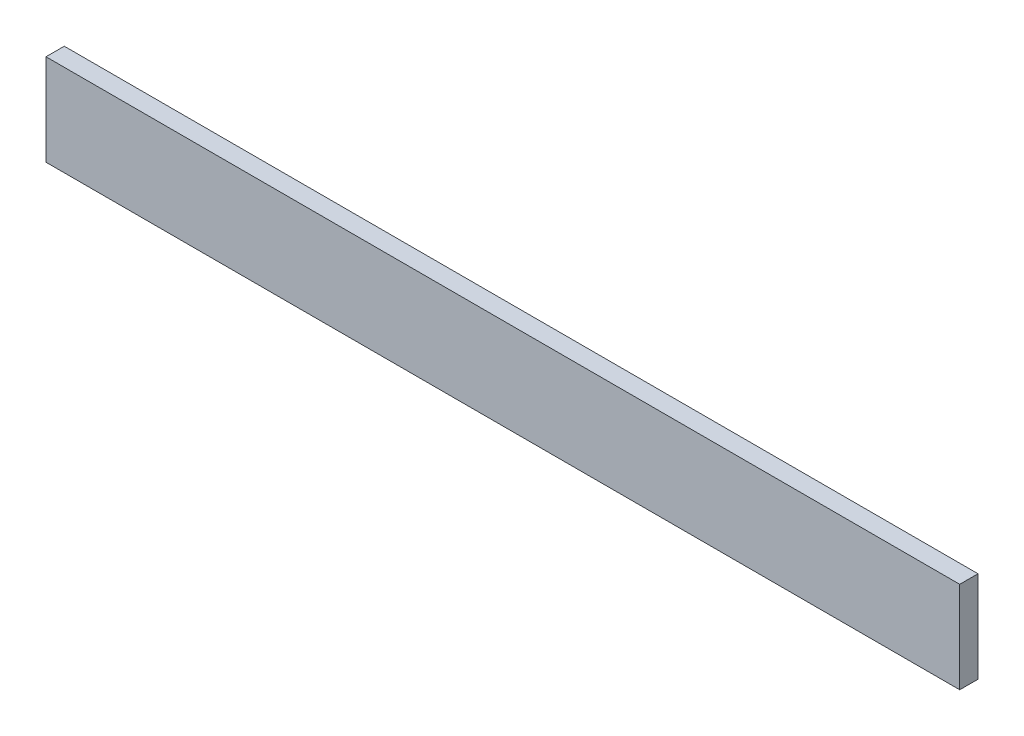
ISO-10303-21;
HEADER;
FILE_DESCRIPTION(('STEP AP214'),'2;1');
FILE_NAME('part.step','',(''),(''),'','','');
FILE_SCHEMA(('AUTOMOTIVE_DESIGN { 1 0 10303 214 1 1 1 1 }'));
ENDSEC;
DATA;
#1=APPLICATION_CONTEXT('core data for automotive mechanical design processes');
#2=APPLICATION_PROTOCOL_DEFINITION('international standard','automotive_design',2000,#1);
#3=PRODUCT_CONTEXT('',#1,'mechanical');
#4=PRODUCT('Part','Part','',(#3));
#5=PRODUCT_RELATED_PRODUCT_CATEGORY('part','',(#4));
#6=PRODUCT_DEFINITION_FORMATION('','',#4);
#7=PRODUCT_DEFINITION_CONTEXT('part definition',#1,'design');
#8=PRODUCT_DEFINITION('design','',#6,#7);
#9=PRODUCT_DEFINITION_SHAPE('','',#8);
#10=(LENGTH_UNIT() NAMED_UNIT(*) SI_UNIT(.MILLI.,.METRE.));
#11=(NAMED_UNIT(*) PLANE_ANGLE_UNIT() SI_UNIT($,.RADIAN.));
#12=(NAMED_UNIT(*) SI_UNIT($,.STERADIAN.) SOLID_ANGLE_UNIT());
#13=UNCERTAINTY_MEASURE_WITH_UNIT(LENGTH_MEASURE(1.E-05),#10,'distance_accuracy_value','');
#14=(GEOMETRIC_REPRESENTATION_CONTEXT(3) GLOBAL_UNCERTAINTY_ASSIGNED_CONTEXT((#13)) GLOBAL_UNIT_ASSIGNED_CONTEXT((#10,
#11,#12)) REPRESENTATION_CONTEXT('',''));
#15=CARTESIAN_POINT('',(0.,0.,0.));
#16=DIRECTION('',(0.,0.,1.));
#17=DIRECTION('',(1.,0.,0.));
#18=AXIS2_PLACEMENT_3D('',#15,#16,#17);
#19=CARTESIAN_POINT('',(317.5,-31.75,12.7));
#20=DIRECTION('',(-1.,0.,0.));
#21=DIRECTION('',(0.,0.,1.));
#22=AXIS2_PLACEMENT_3D('',#19,#20,#21);
#23=PLANE('',#22);
#24=DIRECTION('',(0.,1.,0.));
#25=VECTOR('',#24,1.);
#26=CARTESIAN_POINT('',(317.5,-31.75,0.));
#27=LINE('',#26,#25);
#28=CARTESIAN_POINT('',(317.5,-31.75,0.));
#29=VERTEX_POINT('',#28);
#30=CARTESIAN_POINT('',(317.5,31.75,0.));
#31=VERTEX_POINT('',#30);
#32=EDGE_CURVE('E96',#29,#31,#27,.T.);
#33=ORIENTED_EDGE('',*,*,#32,.T.);
#34=DIRECTION('',(0.,0.,-1.));
#35=VECTOR('',#34,1.);
#36=CARTESIAN_POINT('',(317.5,31.75,12.7));
#37=LINE('',#36,#35);
#38=CARTESIAN_POINT('',(317.5,31.75,12.7));
#39=VERTEX_POINT('',#38);
#40=EDGE_CURVE('E11',#39,#31,#37,.T.);
#41=ORIENTED_EDGE('',*,*,#40,.F.);
#42=DIRECTION('',(0.,1.,0.));
#43=VECTOR('',#42,1.);
#44=CARTESIAN_POINT('',(317.5,-31.75,12.7));
#45=LINE('',#44,#43);
#46=CARTESIAN_POINT('',(317.5,-31.75,12.7));
#47=VERTEX_POINT('',#46);
#48=EDGE_CURVE('E84',#47,#39,#45,.T.);
#49=ORIENTED_EDGE('',*,*,#48,.F.);
#50=DIRECTION('',(0.,0.,-1.));
#51=VECTOR('',#50,1.);
#52=CARTESIAN_POINT('',(317.5,-31.75,12.7));
#53=LINE('',#52,#51);
#54=EDGE_CURVE('E92',#47,#29,#53,.T.);
#55=ORIENTED_EDGE('',*,*,#54,.T.);
#56=EDGE_LOOP('',(#33,#41,#49,#55));
#57=FACE_BOUND('',#56,.T.);
#58=ADVANCED_FACE('F33',(#57),#23,.F.);
#59=CARTESIAN_POINT('',(-317.5,31.75,12.7));
#60=DIRECTION('',(0.,-1.,0.));
#61=DIRECTION('',(0.,0.,-1.));
#62=AXIS2_PLACEMENT_3D('',#59,#60,#61);
#63=PLANE('',#62);
#64=DIRECTION('',(-1.,0.,0.));
#65=VECTOR('',#64,1.);
#66=CARTESIAN_POINT('',(-317.5,31.75,0.));
#67=LINE('',#66,#65);
#68=CARTESIAN_POINT('',(-317.5,31.75,0.));
#69=VERTEX_POINT('',#68);
#70=EDGE_CURVE('E88',#31,#69,#67,.T.);
#71=ORIENTED_EDGE('',*,*,#70,.T.);
#72=DIRECTION('',(0.,0.,-1.));
#73=VECTOR('',#72,1.);
#74=CARTESIAN_POINT('',(-317.5,31.75,12.7));
#75=LINE('',#74,#73);
#76=CARTESIAN_POINT('',(-317.5,31.75,12.7));
#77=VERTEX_POINT('',#76);
#78=EDGE_CURVE('E41',#77,#69,#75,.T.);
#79=ORIENTED_EDGE('',*,*,#78,.F.);
#80=DIRECTION('',(-1.,0.,0.));
#81=VECTOR('',#80,1.);
#82=CARTESIAN_POINT('',(-317.5,31.75,12.7));
#83=LINE('',#82,#81);
#84=EDGE_CURVE('E79',#39,#77,#83,.T.);
#85=ORIENTED_EDGE('',*,*,#84,.F.);
#86=ORIENTED_EDGE('',*,*,#40,.T.);
#87=EDGE_LOOP('',(#71,#79,#85,#86));
#88=FACE_BOUND('',#87,.T.);
#89=ADVANCED_FACE('F87',(#88),#63,.F.);
#90=CARTESIAN_POINT('',(-317.5,-31.75,12.7));
#91=DIRECTION('',(1.,0.,0.));
#92=DIRECTION('',(0.,0.,-1.));
#93=AXIS2_PLACEMENT_3D('',#90,#91,#92);
#94=PLANE('',#93);
#95=DIRECTION('',(0.,-1.,0.));
#96=VECTOR('',#95,1.);
#97=CARTESIAN_POINT('',(-317.5,-31.75,0.));
#98=LINE('',#97,#96);
#99=CARTESIAN_POINT('',(-317.5,-31.75,0.));
#100=VERTEX_POINT('',#99);
#101=EDGE_CURVE('E66',#69,#100,#98,.T.);
#102=ORIENTED_EDGE('',*,*,#101,.T.);
#103=DIRECTION('',(0.,0.,-1.));
#104=VECTOR('',#103,1.);
#105=CARTESIAN_POINT('',(-317.5,-31.75,12.7));
#106=LINE('',#105,#104);
#107=CARTESIAN_POINT('',(-317.5,-31.75,12.7));
#108=VERTEX_POINT('',#107);
#109=EDGE_CURVE('E89',#108,#100,#106,.T.);
#110=ORIENTED_EDGE('',*,*,#109,.F.);
#111=DIRECTION('',(0.,-1.,0.));
#112=VECTOR('',#111,1.);
#113=CARTESIAN_POINT('',(-317.5,-31.75,12.7));
#114=LINE('',#113,#112);
#115=EDGE_CURVE('E82',#77,#108,#114,.T.);
#116=ORIENTED_EDGE('',*,*,#115,.F.);
#117=ORIENTED_EDGE('',*,*,#78,.T.);
#118=EDGE_LOOP('',(#102,#110,#116,#117));
#119=FACE_BOUND('',#118,.T.);
#120=ADVANCED_FACE('F90',(#119),#94,.F.);
#121=CARTESIAN_POINT('',(-317.5,-31.75,12.7));
#122=DIRECTION('',(0.,1.,0.));
#123=DIRECTION('',(0.,0.,1.));
#124=AXIS2_PLACEMENT_3D('',#121,#122,#123);
#125=PLANE('',#124);
#126=DIRECTION('',(1.,0.,0.));
#127=VECTOR('',#126,1.);
#128=CARTESIAN_POINT('',(-317.5,-31.75,0.));
#129=LINE('',#128,#127);
#130=EDGE_CURVE('E72',#100,#29,#129,.T.);
#131=ORIENTED_EDGE('',*,*,#130,.T.);
#132=ORIENTED_EDGE('',*,*,#54,.F.);
#133=DIRECTION('',(1.,0.,0.));
#134=VECTOR('',#133,1.);
#135=CARTESIAN_POINT('',(-317.5,-31.75,12.7));
#136=LINE('',#135,#134);
#137=EDGE_CURVE('E49',#108,#47,#136,.T.);
#138=ORIENTED_EDGE('',*,*,#137,.F.);
#139=ORIENTED_EDGE('',*,*,#109,.T.);
#140=EDGE_LOOP('',(#131,#132,#138,#139));
#141=FACE_BOUND('',#140,.T.);
#142=ADVANCED_FACE('F103',(#141),#125,.F.);
#143=CARTESIAN_POINT('',(0.,0.,12.7));
#144=DIRECTION('',(0.,0.,-1.));
#145=DIRECTION('',(-1.,0.,0.));
#146=AXIS2_PLACEMENT_3D('',#143,#144,#145);
#147=PLANE('',#146);
#148=ORIENTED_EDGE('',*,*,#48,.T.);
#149=ORIENTED_EDGE('',*,*,#84,.T.);
#150=ORIENTED_EDGE('',*,*,#115,.T.);
#151=ORIENTED_EDGE('',*,*,#137,.T.);
#152=EDGE_LOOP('',(#148,#149,#150,#151));
#153=FACE_BOUND('',#152,.T.);
#154=ADVANCED_FACE('F80',(#153),#147,.F.);
#155=CARTESIAN_POINT('',(0.,0.,0.));
#156=DIRECTION('',(0.,0.,-1.));
#157=DIRECTION('',(-1.,0.,0.));
#158=AXIS2_PLACEMENT_3D('',#155,#156,#157);
#159=PLANE('',#158);
#160=ORIENTED_EDGE('',*,*,#32,.F.);
#161=ORIENTED_EDGE('',*,*,#130,.F.);
#162=ORIENTED_EDGE('',*,*,#101,.F.);
#163=ORIENTED_EDGE('',*,*,#70,.F.);
#164=EDGE_LOOP('',(#160,#161,#162,#163));
#165=FACE_BOUND('',#164,.T.);
#166=ADVANCED_FACE('F106',(#165),#159,.T.);
#167=CLOSED_SHELL('',(#58,#89,#120,#142,#154,#166));
#168=MANIFOLD_SOLID_BREP('B2',#167);
#169=ADVANCED_BREP_SHAPE_REPRESENTATION('',(#18,#168),#14);
#170=SHAPE_DEFINITION_REPRESENTATION(#9,#169);
ENDSEC;
END-ISO-10303-21;
